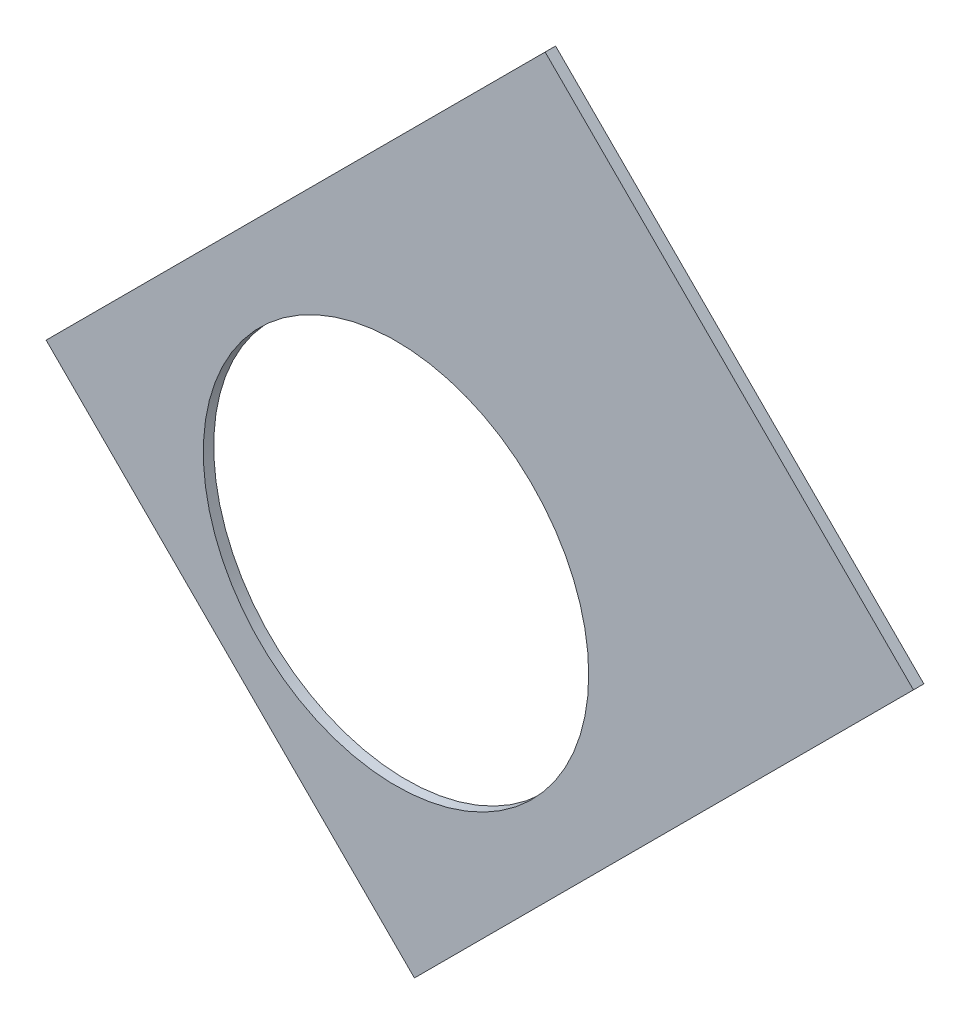
ISO-10303-21;
HEADER;
FILE_DESCRIPTION(('STEP AP214'),'2;1');
FILE_NAME('part.step','',(''),(''),'','','');
FILE_SCHEMA(('AUTOMOTIVE_DESIGN { 1 0 10303 214 1 1 1 1 }'));
ENDSEC;
DATA;
#1=APPLICATION_CONTEXT('core data for automotive mechanical design processes');
#2=APPLICATION_PROTOCOL_DEFINITION('international standard','automotive_design',2000,#1);
#3=PRODUCT_CONTEXT('',#1,'mechanical');
#4=PRODUCT('Part','Part','',(#3));
#5=PRODUCT_RELATED_PRODUCT_CATEGORY('part','',(#4));
#6=PRODUCT_DEFINITION_FORMATION('','',#4);
#7=PRODUCT_DEFINITION_CONTEXT('part definition',#1,'design');
#8=PRODUCT_DEFINITION('design','',#6,#7);
#9=PRODUCT_DEFINITION_SHAPE('','',#8);
#10=(LENGTH_UNIT() NAMED_UNIT(*) SI_UNIT(.MILLI.,.METRE.));
#11=(NAMED_UNIT(*) PLANE_ANGLE_UNIT() SI_UNIT($,.RADIAN.));
#12=(NAMED_UNIT(*) SI_UNIT($,.STERADIAN.) SOLID_ANGLE_UNIT());
#13=UNCERTAINTY_MEASURE_WITH_UNIT(LENGTH_MEASURE(1.E-05),#10,'distance_accuracy_value','');
#14=(GEOMETRIC_REPRESENTATION_CONTEXT(3) GLOBAL_UNCERTAINTY_ASSIGNED_CONTEXT((#13)) GLOBAL_UNIT_ASSIGNED_CONTEXT((#10,
#11,#12)) REPRESENTATION_CONTEXT('',''));
#15=CARTESIAN_POINT('',(0.,0.,0.));
#16=DIRECTION('',(0.,0.,1.));
#17=DIRECTION('',(1.,0.,0.));
#18=AXIS2_PLACEMENT_3D('',#15,#16,#17);
#19=CARTESIAN_POINT('',(0.,0.,0.254));
#20=DIRECTION('',(0.,0.,-1.));
#21=DIRECTION('',(-1.,0.,0.));
#22=AXIS2_PLACEMENT_3D('',#19,#20,#21);
#23=PLANE('',#22);
#24=CARTESIAN_POINT('',(25.5937299450471,25.5937299450471,0.254));
#25=DIRECTION('',(0.,0.,1.));
#26=DIRECTION('',(1.,0.,0.));
#27=AXIS2_PLACEMENT_3D('',#24,#25,#26);
#28=CIRCLE('',#27,4.699);
#29=CARTESIAN_POINT('',(30.2927299450471,25.5937299450471,0.254));
#30=VERTEX_POINT('',#29);
#31=EDGE_CURVE('E100',#30,#30,#28,.T.);
#32=ORIENTED_EDGE('',*,*,#31,.F.);
#33=EDGE_LOOP('',(#32));
#34=FACE_BOUND('',#33,.T.);
#35=DIRECTION('',(-0.707106781186545,0.70710678118655,0.));
#36=VECTOR('',#35,1.);
#37=CARTESIAN_POINT('',(17.0624866300313,26.0427427511007,0.254));
#38=LINE('',#37,#36);
#39=CARTESIAN_POINT('',(26.0427427511005,17.0624866300314,0.254));
#40=VERTEX_POINT('',#39);
#41=CARTESIAN_POINT('',(17.0624866300314,26.0427427511007,0.254));
#42=VERTEX_POINT('',#41);
#43=EDGE_CURVE('E74',#40,#42,#38,.T.);
#44=ORIENTED_EDGE('',*,*,#43,.F.);
#45=DIRECTION('',(-0.707106781186546,-0.707106781186549,0.));
#46=VECTOR('',#45,1.);
#47=CARTESIAN_POINT('',(67.191354125102,58.2110980040331,0.254));
#48=LINE('',#47,#46);
#49=CARTESIAN_POINT('',(38.2109897951492,29.2307336740802,0.254));
#50=VERTEX_POINT('',#49);
#51=EDGE_CURVE('E77',#50,#40,#48,.T.);
#52=ORIENTED_EDGE('',*,*,#51,.F.);
#53=DIRECTION('',(0.707106781186545,-0.70710678118655,0.));
#54=VECTOR('',#53,1.);
#55=CARTESIAN_POINT('',(29.23073367408,38.2109897951494,0.254));
#56=LINE('',#55,#54);
#57=CARTESIAN_POINT('',(29.23073367408,38.2109897951494,0.254));
#58=VERTEX_POINT('',#57);
#59=EDGE_CURVE('E89',#58,#50,#56,.T.);
#60=ORIENTED_EDGE('',*,*,#59,.F.);
#61=DIRECTION('',(-0.707106781186546,-0.707106781186549,0.));
#62=VECTOR('',#61,1.);
#63=CARTESIAN_POINT('',(67.2114671100052,76.1917232310746,0.254));
#64=LINE('',#63,#62);
#65=EDGE_CURVE('E12',#58,#42,#64,.T.);
#66=ORIENTED_EDGE('',*,*,#65,.T.);
#67=EDGE_LOOP('',(#44,#52,#60,#66));
#68=FACE_BOUND('',#67,.T.);
#69=ADVANCED_FACE('F35',(#34,#68),#23,.F.);
#70=CARTESIAN_POINT('',(0.,0.,0.));
#71=DIRECTION('',(0.,0.,-1.));
#72=DIRECTION('',(-1.,0.,0.));
#73=AXIS2_PLACEMENT_3D('',#70,#71,#72);
#74=PLANE('',#73);
#75=CARTESIAN_POINT('',(25.5937299450471,25.5937299450471,0.));
#76=DIRECTION('',(0.,0.,1.));
#77=DIRECTION('',(1.,0.,0.));
#78=AXIS2_PLACEMENT_3D('',#75,#76,#77);
#79=CIRCLE('',#78,4.699);
#80=CARTESIAN_POINT('',(30.2927299450471,25.5937299450471,0.));
#81=VERTEX_POINT('',#80);
#82=EDGE_CURVE('E97',#81,#81,#79,.T.);
#83=ORIENTED_EDGE('',*,*,#82,.T.);
#84=EDGE_LOOP('',(#83));
#85=FACE_BOUND('',#84,.T.);
#86=DIRECTION('',(-0.707106781186546,-0.707106781186549,0.));
#87=VECTOR('',#86,1.);
#88=CARTESIAN_POINT('',(67.191354125102,58.2110980040331,0.));
#89=LINE('',#88,#87);
#90=CARTESIAN_POINT('',(38.2109897951492,29.2307336740802,0.));
#91=VERTEX_POINT('',#90);
#92=CARTESIAN_POINT('',(26.0427427511005,17.0624866300314,0.));
#93=VERTEX_POINT('',#92);
#94=EDGE_CURVE('E95',#91,#93,#89,.T.);
#95=ORIENTED_EDGE('',*,*,#94,.T.);
#96=DIRECTION('',(-0.707106781186545,0.70710678118655,0.));
#97=VECTOR('',#96,1.);
#98=CARTESIAN_POINT('',(17.0624866300313,26.0427427511007,0.));
#99=LINE('',#98,#97);
#100=CARTESIAN_POINT('',(17.0624866300313,26.0427427511007,0.));
#101=VERTEX_POINT('',#100);
#102=EDGE_CURVE('E79',#93,#101,#99,.T.);
#103=ORIENTED_EDGE('',*,*,#102,.T.);
#104=DIRECTION('',(-0.707106781186546,-0.707106781186549,0.));
#105=VECTOR('',#104,1.);
#106=CARTESIAN_POINT('',(67.2114671100052,76.1917232310746,0.));
#107=LINE('',#106,#105);
#108=CARTESIAN_POINT('',(29.23073367408,38.2109897951494,0.));
#109=VERTEX_POINT('',#108);
#110=EDGE_CURVE('E39',#109,#101,#107,.T.);
#111=ORIENTED_EDGE('',*,*,#110,.F.);
#112=DIRECTION('',(0.707106781186545,-0.70710678118655,0.));
#113=VECTOR('',#112,1.);
#114=CARTESIAN_POINT('',(29.23073367408,38.2109897951494,0.));
#115=LINE('',#114,#113);
#116=EDGE_CURVE('E109',#109,#91,#115,.T.);
#117=ORIENTED_EDGE('',*,*,#116,.T.);
#118=EDGE_LOOP('',(#95,#103,#111,#117));
#119=FACE_BOUND('',#118,.T.);
#120=ADVANCED_FACE('F113',(#85,#119),#74,.T.);
#121=CARTESIAN_POINT('',(67.191354125102,58.2110980040331,0.254));
#122=DIRECTION('',(0.707106781186549,-0.707106781186546,0.));
#123=DIRECTION('',(0.707106781186546,0.707106781186549,0.));
#124=AXIS2_PLACEMENT_3D('',#121,#122,#123);
#125=PLANE('',#124);
#126=ORIENTED_EDGE('',*,*,#51,.T.);
#127=DIRECTION('',(0.,0.,-1.));
#128=VECTOR('',#127,1.);
#129=CARTESIAN_POINT('',(26.0427427511005,17.0624866300314,0.254));
#130=LINE('',#129,#128);
#131=EDGE_CURVE('E83',#40,#93,#130,.T.);
#132=ORIENTED_EDGE('',*,*,#131,.T.);
#133=ORIENTED_EDGE('',*,*,#94,.F.);
#134=DIRECTION('',(0.,0.,1.));
#135=VECTOR('',#134,1.);
#136=CARTESIAN_POINT('',(38.2109897951492,29.2307336740802,0.254));
#137=LINE('',#136,#135);
#138=EDGE_CURVE('E90',#91,#50,#137,.T.);
#139=ORIENTED_EDGE('',*,*,#138,.T.);
#140=EDGE_LOOP('',(#126,#132,#133,#139));
#141=FACE_BOUND('',#140,.T.);
#142=ADVANCED_FACE('F93',(#141),#125,.T.);
#143=CARTESIAN_POINT('',(67.2114671100052,76.1917232310746,0.254));
#144=DIRECTION('',(0.707106781186549,-0.707106781186546,0.));
#145=DIRECTION('',(0.707106781186546,0.707106781186549,0.));
#146=AXIS2_PLACEMENT_3D('',#143,#144,#145);
#147=PLANE('',#146);
#148=ORIENTED_EDGE('',*,*,#65,.F.);
#149=DIRECTION('',(0.,0.,1.));
#150=VECTOR('',#149,1.);
#151=CARTESIAN_POINT('',(29.23073367408,38.2109897951494,0.));
#152=LINE('',#151,#150);
#153=EDGE_CURVE('E80',#109,#58,#152,.T.);
#154=ORIENTED_EDGE('',*,*,#153,.F.);
#155=ORIENTED_EDGE('',*,*,#110,.T.);
#156=DIRECTION('',(0.,0.,1.));
#157=VECTOR('',#156,1.);
#158=CARTESIAN_POINT('',(17.0624866300313,26.0427427511007,0.));
#159=LINE('',#158,#157);
#160=EDGE_CURVE('E103',#101,#42,#159,.T.);
#161=ORIENTED_EDGE('',*,*,#160,.T.);
#162=EDGE_LOOP('',(#148,#154,#155,#161));
#163=FACE_BOUND('',#162,.T.);
#164=ADVANCED_FACE('F37',(#163),#147,.F.);
#165=CARTESIAN_POINT('',(25.5937299450471,25.5937299450471,0.));
#166=DIRECTION('',(0.,0.,1.));
#167=DIRECTION('',(1.,0.,0.));
#168=AXIS2_PLACEMENT_3D('',#165,#166,#167);
#169=CYLINDRICAL_SURFACE('',#168,4.699);
#170=ORIENTED_EDGE('',*,*,#82,.F.);
#171=EDGE_LOOP('',(#170));
#172=FACE_BOUND('',#171,.T.);
#173=ORIENTED_EDGE('',*,*,#31,.T.);
#174=EDGE_LOOP('',(#173));
#175=FACE_BOUND('',#174,.T.);
#176=ADVANCED_FACE('F117',(#172,#175),#169,.F.);
#177=CARTESIAN_POINT('',(17.0624866300313,26.0427427511007,0.));
#178=DIRECTION('',(0.70710678118655,0.707106781186545,0.));
#179=DIRECTION('',(-0.707106781186545,0.70710678118655,0.));
#180=AXIS2_PLACEMENT_3D('',#177,#178,#179);
#181=PLANE('',#180);
#182=ORIENTED_EDGE('',*,*,#43,.T.);
#183=ORIENTED_EDGE('',*,*,#160,.F.);
#184=ORIENTED_EDGE('',*,*,#102,.F.);
#185=ORIENTED_EDGE('',*,*,#131,.F.);
#186=EDGE_LOOP('',(#182,#183,#184,#185));
#187=FACE_BOUND('',#186,.T.);
#188=ADVANCED_FACE('F84',(#187),#181,.F.);
#189=CARTESIAN_POINT('',(29.23073367408,38.2109897951494,0.));
#190=DIRECTION('',(-0.70710678118655,-0.707106781186545,0.));
#191=DIRECTION('',(0.707106781186545,-0.70710678118655,0.));
#192=AXIS2_PLACEMENT_3D('',#189,#190,#191);
#193=PLANE('',#192);
#194=ORIENTED_EDGE('',*,*,#59,.T.);
#195=ORIENTED_EDGE('',*,*,#138,.F.);
#196=ORIENTED_EDGE('',*,*,#116,.F.);
#197=ORIENTED_EDGE('',*,*,#153,.T.);
#198=EDGE_LOOP('',(#194,#195,#196,#197));
#199=FACE_BOUND('',#198,.T.);
#200=ADVANCED_FACE('F115',(#199),#193,.F.);
#201=CLOSED_SHELL('',(#69,#120,#142,#164,#176,#188,#200));
#202=MANIFOLD_SOLID_BREP('B2',#201);
#203=ADVANCED_BREP_SHAPE_REPRESENTATION('',(#18,#202),#14);
#204=SHAPE_DEFINITION_REPRESENTATION(#9,#203);
ENDSEC;
END-ISO-10303-21;
